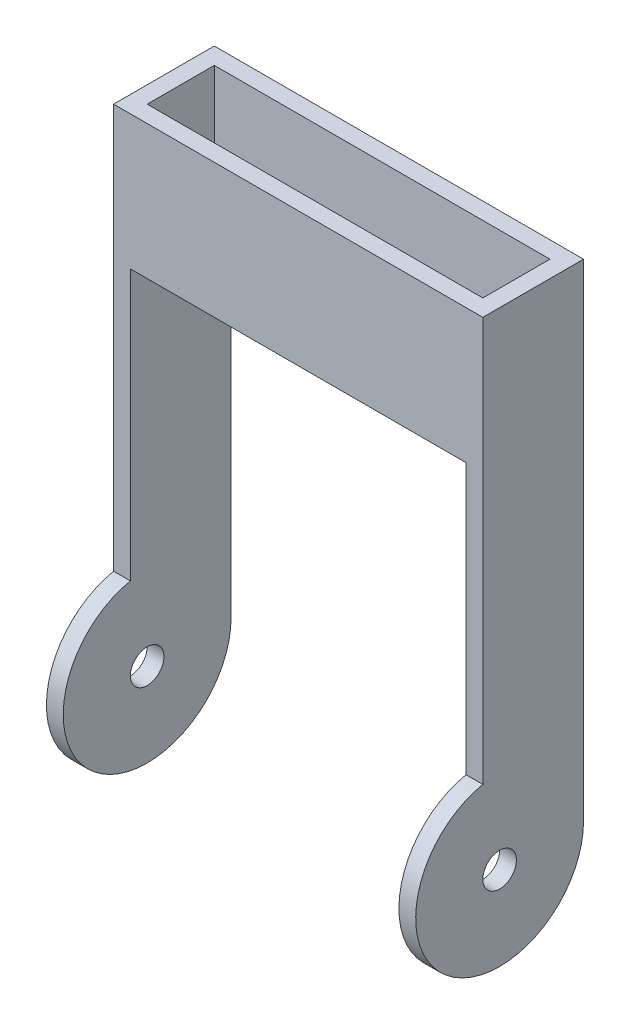
ISO-10303-21;
HEADER;
FILE_DESCRIPTION(('STEP AP214'),'2;1');
FILE_NAME('part.step','',(''),(''),'','','');
FILE_SCHEMA(('AUTOMOTIVE_DESIGN { 1 0 10303 214 1 1 1 1 }'));
ENDSEC;
DATA;
#1=APPLICATION_CONTEXT('core data for automotive mechanical design processes');
#2=APPLICATION_PROTOCOL_DEFINITION('international standard','automotive_design',2000,#1);
#3=PRODUCT_CONTEXT('',#1,'mechanical');
#4=PRODUCT('Part','Part','',(#3));
#5=PRODUCT_RELATED_PRODUCT_CATEGORY('part','',(#4));
#6=PRODUCT_DEFINITION_FORMATION('','',#4);
#7=PRODUCT_DEFINITION_CONTEXT('part definition',#1,'design');
#8=PRODUCT_DEFINITION('design','',#6,#7);
#9=PRODUCT_DEFINITION_SHAPE('','',#8);
#10=(LENGTH_UNIT() NAMED_UNIT(*) SI_UNIT(.MILLI.,.METRE.));
#11=(NAMED_UNIT(*) PLANE_ANGLE_UNIT() SI_UNIT($,.RADIAN.));
#12=(NAMED_UNIT(*) SI_UNIT($,.STERADIAN.) SOLID_ANGLE_UNIT());
#13=UNCERTAINTY_MEASURE_WITH_UNIT(LENGTH_MEASURE(1.E-05),#10,'distance_accuracy_value','');
#14=(GEOMETRIC_REPRESENTATION_CONTEXT(3) GLOBAL_UNCERTAINTY_ASSIGNED_CONTEXT((#13)) GLOBAL_UNIT_ASSIGNED_CONTEXT((#10,
#11,#12)) REPRESENTATION_CONTEXT('',''));
#15=CARTESIAN_POINT('',(0.,0.,0.));
#16=DIRECTION('',(0.,0.,1.));
#17=DIRECTION('',(1.,0.,0.));
#18=AXIS2_PLACEMENT_3D('',#15,#16,#17);
#19=CARTESIAN_POINT('',(0.,0.,0.));
#20=DIRECTION('',(0.,1.,0.));
#21=DIRECTION('',(0.,0.,1.));
#22=AXIS2_PLACEMENT_3D('',#19,#20,#21);
#23=PLANE('',#22);
#24=DIRECTION('',(0.,0.,1.));
#25=VECTOR('',#24,1.);
#26=CARTESIAN_POINT('',(-31.75,0.,-9.525));
#27=LINE('',#26,#25);
#28=CARTESIAN_POINT('',(-31.75,0.,-9.525));
#29=VERTEX_POINT('',#28);
#30=CARTESIAN_POINT('',(-31.75,0.,-6.35));
#31=VERTEX_POINT('',#30);
#32=EDGE_CURVE('E76',#29,#31,#27,.T.);
#33=ORIENTED_EDGE('',*,*,#32,.F.);
#34=DIRECTION('',(-1.,0.,0.));
#35=VECTOR('',#34,1.);
#36=CARTESIAN_POINT('',(0.,0.,-9.525));
#37=LINE('',#36,#35);
#38=CARTESIAN_POINT('',(31.75,0.,-9.525));
#39=VERTEX_POINT('',#38);
#40=EDGE_CURVE('E228',#39,#29,#37,.T.);
#41=ORIENTED_EDGE('',*,*,#40,.F.);
#42=DIRECTION('',(0.,0.,-1.));
#43=VECTOR('',#42,1.);
#44=CARTESIAN_POINT('',(31.75,0.,-9.525));
#45=LINE('',#44,#43);
#46=CARTESIAN_POINT('',(31.75,0.,-6.35));
#47=VERTEX_POINT('',#46);
#48=EDGE_CURVE('E12',#47,#39,#45,.T.);
#49=ORIENTED_EDGE('',*,*,#48,.F.);
#50=DIRECTION('',(-1.,0.,0.));
#51=VECTOR('',#50,1.);
#52=CARTESIAN_POINT('',(-31.75,0.,-6.35));
#53=LINE('',#52,#51);
#54=EDGE_CURVE('E198',#47,#31,#53,.T.);
#55=ORIENTED_EDGE('',*,*,#54,.T.);
#56=EDGE_LOOP('',(#33,#41,#49,#55));
#57=FACE_BOUND('',#56,.T.);
#58=ADVANCED_FACE('F58',(#57),#23,.F.);
#59=CARTESIAN_POINT('',(-31.75,0.,6.35));
#60=VERTEX_POINT('',#59);
#61=CARTESIAN_POINT('',(-31.75,0.,9.525));
#62=VERTEX_POINT('',#61);
#63=EDGE_CURVE('E172',#60,#62,#27,.T.);
#64=ORIENTED_EDGE('',*,*,#63,.F.);
#65=DIRECTION('',(1.,0.,0.));
#66=VECTOR('',#65,1.);
#67=CARTESIAN_POINT('',(-31.75,0.,6.35));
#68=LINE('',#67,#66);
#69=CARTESIAN_POINT('',(31.75,0.,6.35));
#70=VERTEX_POINT('',#69);
#71=EDGE_CURVE('E209',#60,#70,#68,.T.);
#72=ORIENTED_EDGE('',*,*,#71,.T.);
#73=CARTESIAN_POINT('',(31.75,0.,9.525));
#74=VERTEX_POINT('',#73);
#75=EDGE_CURVE('E69',#74,#70,#45,.T.);
#76=ORIENTED_EDGE('',*,*,#75,.F.);
#77=DIRECTION('',(1.,0.,0.));
#78=VECTOR('',#77,1.);
#79=CARTESIAN_POINT('',(0.,0.,9.525));
#80=LINE('',#79,#78);
#81=EDGE_CURVE('E84',#62,#74,#80,.T.);
#82=ORIENTED_EDGE('',*,*,#81,.F.);
#83=EDGE_LOOP('',(#64,#72,#76,#82));
#84=FACE_BOUND('',#83,.T.);
#85=ADVANCED_FACE('F272',(#84),#23,.F.);
#86=CARTESIAN_POINT('',(0.,25.4,0.));
#87=DIRECTION('',(0.,1.,0.));
#88=DIRECTION('',(0.,0.,1.));
#89=AXIS2_PLACEMENT_3D('',#86,#87,#88);
#90=PLANE('',#89);
#91=DIRECTION('',(0.,0.,-1.));
#92=VECTOR('',#91,1.);
#93=CARTESIAN_POINT('',(34.925,25.4,0.));
#94=LINE('',#93,#92);
#95=CARTESIAN_POINT('',(34.925,25.4,9.525));
#96=VERTEX_POINT('',#95);
#97=CARTESIAN_POINT('',(34.925,25.4,-9.525));
#98=VERTEX_POINT('',#97);
#99=EDGE_CURVE('E229',#96,#98,#94,.T.);
#100=ORIENTED_EDGE('',*,*,#99,.T.);
#101=DIRECTION('',(-1.,0.,0.));
#102=VECTOR('',#101,1.);
#103=CARTESIAN_POINT('',(0.,25.4,-9.525));
#104=LINE('',#103,#102);
#105=CARTESIAN_POINT('',(-34.925,25.4,-9.525));
#106=VERTEX_POINT('',#105);
#107=EDGE_CURVE('E232',#98,#106,#104,.T.);
#108=ORIENTED_EDGE('',*,*,#107,.T.);
#109=DIRECTION('',(0.,0.,1.));
#110=VECTOR('',#109,1.);
#111=CARTESIAN_POINT('',(-34.925,25.4,0.));
#112=LINE('',#111,#110);
#113=CARTESIAN_POINT('',(-34.925,25.4,9.525));
#114=VERTEX_POINT('',#113);
#115=EDGE_CURVE('E234',#106,#114,#112,.T.);
#116=ORIENTED_EDGE('',*,*,#115,.T.);
#117=DIRECTION('',(1.,0.,0.));
#118=VECTOR('',#117,1.);
#119=CARTESIAN_POINT('',(0.,25.4,9.525));
#120=LINE('',#119,#118);
#121=EDGE_CURVE('E236',#114,#96,#120,.T.);
#122=ORIENTED_EDGE('',*,*,#121,.T.);
#123=EDGE_LOOP('',(#100,#108,#116,#122));
#124=FACE_BOUND('',#123,.T.);
#125=DIRECTION('',(-1.,0.,0.));
#126=VECTOR('',#125,1.);
#127=CARTESIAN_POINT('',(-31.75,25.4,-6.35));
#128=LINE('',#127,#126);
#129=CARTESIAN_POINT('',(31.75,25.4,-6.35));
#130=VERTEX_POINT('',#129);
#131=CARTESIAN_POINT('',(-31.75,25.4,-6.35));
#132=VERTEX_POINT('',#131);
#133=EDGE_CURVE('E208',#130,#132,#128,.T.);
#134=ORIENTED_EDGE('',*,*,#133,.F.);
#135=DIRECTION('',(0.,0.,-1.));
#136=VECTOR('',#135,1.);
#137=CARTESIAN_POINT('',(31.75,25.4,6.35));
#138=LINE('',#137,#136);
#139=CARTESIAN_POINT('',(31.75,25.4,6.35));
#140=VERTEX_POINT('',#139);
#141=EDGE_CURVE('E206',#140,#130,#138,.T.);
#142=ORIENTED_EDGE('',*,*,#141,.F.);
#143=DIRECTION('',(1.,0.,0.));
#144=VECTOR('',#143,1.);
#145=CARTESIAN_POINT('',(-31.75,25.4,6.35));
#146=LINE('',#145,#144);
#147=CARTESIAN_POINT('',(-31.75,25.4,6.35));
#148=VERTEX_POINT('',#147);
#149=EDGE_CURVE('E214',#148,#140,#146,.T.);
#150=ORIENTED_EDGE('',*,*,#149,.F.);
#151=DIRECTION('',(0.,0.,1.));
#152=VECTOR('',#151,1.);
#153=CARTESIAN_POINT('',(-31.75,25.4,6.35));
#154=LINE('',#153,#152);
#155=EDGE_CURVE('E211',#132,#148,#154,.T.);
#156=ORIENTED_EDGE('',*,*,#155,.F.);
#157=EDGE_LOOP('',(#134,#142,#150,#156));
#158=FACE_BOUND('',#157,.T.);
#159=ADVANCED_FACE('F266',(#124,#158),#90,.T.);
#160=CARTESIAN_POINT('',(34.925,25.4,0.));
#161=DIRECTION('',(-1.,0.,0.));
#162=DIRECTION('',(0.,0.,1.));
#163=AXIS2_PLACEMENT_3D('',#160,#161,#162);
#164=PLANE('',#163);
#165=CARTESIAN_POINT('',(34.925,-66.675,6.35));
#166=DIRECTION('',(-1.,0.,0.));
#167=DIRECTION('',(0.,0.,1.));
#168=AXIS2_PLACEMENT_3D('',#165,#166,#167);
#169=CIRCLE('',#168,3.175);
#170=CARTESIAN_POINT('',(34.925,-66.675,9.525));
#171=VERTEX_POINT('',#170);
#172=EDGE_CURVE('E297',#171,#171,#169,.F.);
#173=ORIENTED_EDGE('',*,*,#172,.F.);
#174=EDGE_LOOP('',(#173));
#175=FACE_BOUND('',#174,.T.);
#176=DIRECTION('',(0.,-1.,0.));
#177=VECTOR('',#176,1.);
#178=CARTESIAN_POINT('',(34.925,25.4,9.525));
#179=LINE('',#178,#177);
#180=CARTESIAN_POINT('',(34.925,-51.1207401333268,9.525));
#181=VERTEX_POINT('',#180);
#182=EDGE_CURVE('E238',#96,#181,#179,.T.);
#183=ORIENTED_EDGE('',*,*,#182,.T.);
#184=CARTESIAN_POINT('',(34.925,-66.675,6.35));
#185=DIRECTION('',(1.,0.,0.));
#186=DIRECTION('',(0.,0.,-1.));
#187=AXIS2_PLACEMENT_3D('',#184,#185,#186);
#188=CIRCLE('',#187,15.875);
#189=CARTESIAN_POINT('',(34.925,-66.675,-9.525));
#190=VERTEX_POINT('',#189);
#191=EDGE_CURVE('E189',#181,#190,#188,.T.);
#192=ORIENTED_EDGE('',*,*,#191,.T.);
#193=DIRECTION('',(0.,-1.,0.));
#194=VECTOR('',#193,1.);
#195=CARTESIAN_POINT('',(34.925,25.4,-9.525));
#196=LINE('',#195,#194);
#197=EDGE_CURVE('E67',#98,#190,#196,.T.);
#198=ORIENTED_EDGE('',*,*,#197,.F.);
#199=ORIENTED_EDGE('',*,*,#99,.F.);
#200=EDGE_LOOP('',(#183,#192,#198,#199));
#201=FACE_BOUND('',#200,.T.);
#202=ADVANCED_FACE('F60',(#175,#201),#164,.F.);
#203=CARTESIAN_POINT('',(0.,25.4,-9.525));
#204=DIRECTION('',(0.,0.,1.));
#205=DIRECTION('',(1.,0.,0.));
#206=AXIS2_PLACEMENT_3D('',#203,#204,#205);
#207=PLANE('',#206);
#208=ORIENTED_EDGE('',*,*,#197,.T.);
#209=DIRECTION('',(-1.,0.,0.));
#210=VECTOR('',#209,1.);
#211=CARTESIAN_POINT('',(34.925,-66.675,-9.525));
#212=LINE('',#211,#210);
#213=CARTESIAN_POINT('',(31.75,-66.675,-9.525));
#214=VERTEX_POINT('',#213);
#215=EDGE_CURVE('E199',#214,#190,#212,.F.);
#216=ORIENTED_EDGE('',*,*,#215,.F.);
#217=DIRECTION('',(0.,1.,0.));
#218=VECTOR('',#217,1.);
#219=CARTESIAN_POINT('',(31.75,-82.551,-9.525));
#220=LINE('',#219,#218);
#221=EDGE_CURVE('E194',#214,#39,#220,.T.);
#222=ORIENTED_EDGE('',*,*,#221,.T.);
#223=ORIENTED_EDGE('',*,*,#40,.T.);
#224=DIRECTION('',(0.,1.,0.));
#225=VECTOR('',#224,1.);
#226=CARTESIAN_POINT('',(-31.75,-82.551,-9.525));
#227=LINE('',#226,#225);
#228=CARTESIAN_POINT('',(-31.75,-66.675,-9.525));
#229=VERTEX_POINT('',#228);
#230=EDGE_CURVE('E164',#229,#29,#227,.T.);
#231=ORIENTED_EDGE('',*,*,#230,.F.);
#232=DIRECTION('',(-1.,0.,0.));
#233=VECTOR('',#232,1.);
#234=CARTESIAN_POINT('',(34.925,-66.675,-9.525));
#235=LINE('',#234,#233);
#236=CARTESIAN_POINT('',(-34.925,-66.675,-9.525));
#237=VERTEX_POINT('',#236);
#238=EDGE_CURVE('E163',#237,#229,#235,.F.);
#239=ORIENTED_EDGE('',*,*,#238,.F.);
#240=DIRECTION('',(0.,-1.,0.));
#241=VECTOR('',#240,1.);
#242=CARTESIAN_POINT('',(-34.925,25.4,-9.525));
#243=LINE('',#242,#241);
#244=EDGE_CURVE('E243',#106,#237,#243,.T.);
#245=ORIENTED_EDGE('',*,*,#244,.F.);
#246=ORIENTED_EDGE('',*,*,#107,.F.);
#247=EDGE_LOOP('',(#208,#216,#222,#223,#231,#239,#245,#246));
#248=FACE_BOUND('',#247,.T.);
#249=ADVANCED_FACE('F246',(#248),#207,.F.);
#250=CARTESIAN_POINT('',(-34.925,25.4,0.));
#251=DIRECTION('',(1.,0.,0.));
#252=DIRECTION('',(0.,0.,-1.));
#253=AXIS2_PLACEMENT_3D('',#250,#251,#252);
#254=PLANE('',#253);
#255=CARTESIAN_POINT('',(-34.925,-66.675,6.35));
#256=DIRECTION('',(-1.,0.,0.));
#257=DIRECTION('',(0.,0.,1.));
#258=AXIS2_PLACEMENT_3D('',#255,#256,#257);
#259=CIRCLE('',#258,3.175);
#260=CARTESIAN_POINT('',(-34.925,-66.675,9.525));
#261=VERTEX_POINT('',#260);
#262=EDGE_CURVE('E299',#261,#261,#259,.T.);
#263=ORIENTED_EDGE('',*,*,#262,.F.);
#264=EDGE_LOOP('',(#263));
#265=FACE_BOUND('',#264,.T.);
#266=ORIENTED_EDGE('',*,*,#244,.T.);
#267=CARTESIAN_POINT('',(-34.925,-66.675,6.35));
#268=DIRECTION('',(1.,0.,0.));
#269=DIRECTION('',(0.,0.,-1.));
#270=AXIS2_PLACEMENT_3D('',#267,#268,#269);
#271=CIRCLE('',#270,15.875);
#272=CARTESIAN_POINT('',(-34.925,-51.1207401333268,9.525));
#273=VERTEX_POINT('',#272);
#274=EDGE_CURVE('E177',#273,#237,#271,.T.);
#275=ORIENTED_EDGE('',*,*,#274,.F.);
#276=DIRECTION('',(0.,-1.,0.));
#277=VECTOR('',#276,1.);
#278=CARTESIAN_POINT('',(-34.925,25.4,9.525));
#279=LINE('',#278,#277);
#280=EDGE_CURVE('E158',#114,#273,#279,.T.);
#281=ORIENTED_EDGE('',*,*,#280,.F.);
#282=ORIENTED_EDGE('',*,*,#115,.F.);
#283=EDGE_LOOP('',(#266,#275,#281,#282));
#284=FACE_BOUND('',#283,.T.);
#285=ADVANCED_FACE('F285',(#265,#284),#254,.F.);
#286=CARTESIAN_POINT('',(0.,25.4,9.525));
#287=DIRECTION('',(0.,0.,-1.));
#288=DIRECTION('',(-1.,0.,0.));
#289=AXIS2_PLACEMENT_3D('',#286,#287,#288);
#290=PLANE('',#289);
#291=ORIENTED_EDGE('',*,*,#280,.T.);
#292=DIRECTION('',(-1.,0.,0.));
#293=VECTOR('',#292,1.);
#294=CARTESIAN_POINT('',(34.925,-51.1207401333268,9.525));
#295=LINE('',#294,#293);
#296=CARTESIAN_POINT('',(-31.75,-51.1207401333268,9.525));
#297=VERTEX_POINT('',#296);
#298=EDGE_CURVE('E152',#297,#273,#295,.T.);
#299=ORIENTED_EDGE('',*,*,#298,.F.);
#300=DIRECTION('',(0.,1.,0.));
#301=VECTOR('',#300,1.);
#302=CARTESIAN_POINT('',(-31.75,-82.551,9.525));
#303=LINE('',#302,#301);
#304=EDGE_CURVE('E155',#297,#62,#303,.T.);
#305=ORIENTED_EDGE('',*,*,#304,.T.);
#306=ORIENTED_EDGE('',*,*,#81,.T.);
#307=DIRECTION('',(0.,1.,0.));
#308=VECTOR('',#307,1.);
#309=CARTESIAN_POINT('',(31.75,-82.551,9.525));
#310=LINE('',#309,#308);
#311=CARTESIAN_POINT('',(31.75,-51.1207401333268,9.525));
#312=VERTEX_POINT('',#311);
#313=EDGE_CURVE('E191',#312,#74,#310,.T.);
#314=ORIENTED_EDGE('',*,*,#313,.F.);
#315=DIRECTION('',(-1.,0.,0.));
#316=VECTOR('',#315,1.);
#317=CARTESIAN_POINT('',(34.925,-51.1207401333268,9.525));
#318=LINE('',#317,#316);
#319=EDGE_CURVE('E195',#181,#312,#318,.T.);
#320=ORIENTED_EDGE('',*,*,#319,.F.);
#321=ORIENTED_EDGE('',*,*,#182,.F.);
#322=ORIENTED_EDGE('',*,*,#121,.F.);
#323=EDGE_LOOP('',(#291,#299,#305,#306,#314,#320,#321,#322));
#324=FACE_BOUND('',#323,.T.);
#325=ADVANCED_FACE('F154',(#324),#290,.F.);
#326=CARTESIAN_POINT('',(31.75,25.4,6.35));
#327=DIRECTION('',(-1.,0.,0.));
#328=DIRECTION('',(0.,0.,1.));
#329=AXIS2_PLACEMENT_3D('',#326,#327,#328);
#330=PLANE('',#329);
#331=CARTESIAN_POINT('',(31.75,-66.675,6.35));
#332=DIRECTION('',(-1.,0.,0.));
#333=DIRECTION('',(0.,0.,1.));
#334=AXIS2_PLACEMENT_3D('',#331,#332,#333);
#335=CIRCLE('',#334,3.175);
#336=CARTESIAN_POINT('',(31.75,-66.675,9.525));
#337=VERTEX_POINT('',#336);
#338=EDGE_CURVE('E180',#337,#337,#335,.T.);
#339=ORIENTED_EDGE('',*,*,#338,.F.);
#340=EDGE_LOOP('',(#339));
#341=FACE_BOUND('',#340,.T.);
#342=DIRECTION('',(0.,-1.,0.));
#343=VECTOR('',#342,1.);
#344=CARTESIAN_POINT('',(31.75,25.4,-6.35));
#345=LINE('',#344,#343);
#346=EDGE_CURVE('E225',#130,#47,#345,.T.);
#347=ORIENTED_EDGE('',*,*,#346,.T.);
#348=ORIENTED_EDGE('',*,*,#48,.T.);
#349=ORIENTED_EDGE('',*,*,#221,.F.);
#350=CARTESIAN_POINT('',(31.75,-66.675,6.35));
#351=DIRECTION('',(1.,0.,0.));
#352=DIRECTION('',(0.,0.,-1.));
#353=AXIS2_PLACEMENT_3D('',#350,#351,#352);
#354=CIRCLE('',#353,15.875);
#355=EDGE_CURVE('E184',#312,#214,#354,.T.);
#356=ORIENTED_EDGE('',*,*,#355,.F.);
#357=ORIENTED_EDGE('',*,*,#313,.T.);
#358=ORIENTED_EDGE('',*,*,#75,.T.);
#359=DIRECTION('',(0.,-1.,0.));
#360=VECTOR('',#359,1.);
#361=CARTESIAN_POINT('',(31.75,25.4,6.35));
#362=LINE('',#361,#360);
#363=EDGE_CURVE('E216',#140,#70,#362,.T.);
#364=ORIENTED_EDGE('',*,*,#363,.F.);
#365=ORIENTED_EDGE('',*,*,#141,.T.);
#366=EDGE_LOOP('',(#347,#348,#349,#356,#357,#358,#364,#365));
#367=FACE_BOUND('',#366,.T.);
#368=ADVANCED_FACE('F258',(#341,#367),#330,.T.);
#369=CARTESIAN_POINT('',(-31.75,25.4,-6.35));
#370=DIRECTION('',(0.,0.,1.));
#371=DIRECTION('',(1.,0.,0.));
#372=AXIS2_PLACEMENT_3D('',#369,#370,#371);
#373=PLANE('',#372);
#374=ORIENTED_EDGE('',*,*,#54,.F.);
#375=ORIENTED_EDGE('',*,*,#346,.F.);
#376=ORIENTED_EDGE('',*,*,#133,.T.);
#377=DIRECTION('',(0.,-1.,0.));
#378=VECTOR('',#377,1.);
#379=CARTESIAN_POINT('',(-31.75,25.4,-6.35));
#380=LINE('',#379,#378);
#381=EDGE_CURVE('E223',#132,#31,#380,.T.);
#382=ORIENTED_EDGE('',*,*,#381,.T.);
#383=EDGE_LOOP('',(#374,#375,#376,#382));
#384=FACE_BOUND('',#383,.T.);
#385=ADVANCED_FACE('F310',(#384),#373,.T.);
#386=CARTESIAN_POINT('',(-31.75,25.4,6.35));
#387=DIRECTION('',(1.,0.,0.));
#388=DIRECTION('',(0.,0.,-1.));
#389=AXIS2_PLACEMENT_3D('',#386,#387,#388);
#390=PLANE('',#389);
#391=CARTESIAN_POINT('',(-31.75,-66.675,6.35));
#392=DIRECTION('',(1.,0.,0.));
#393=DIRECTION('',(0.,0.,-1.));
#394=AXIS2_PLACEMENT_3D('',#391,#392,#393);
#395=CIRCLE('',#394,3.175);
#396=CARTESIAN_POINT('',(-31.75,-66.675,3.175));
#397=VERTEX_POINT('',#396);
#398=EDGE_CURVE('E62',#397,#397,#395,.T.);
#399=ORIENTED_EDGE('',*,*,#398,.F.);
#400=EDGE_LOOP('',(#399));
#401=FACE_BOUND('',#400,.T.);
#402=DIRECTION('',(0.,-1.,0.));
#403=VECTOR('',#402,1.);
#404=CARTESIAN_POINT('',(-31.75,25.4,6.35));
#405=LINE('',#404,#403);
#406=EDGE_CURVE('E221',#148,#60,#405,.T.);
#407=ORIENTED_EDGE('',*,*,#406,.T.);
#408=ORIENTED_EDGE('',*,*,#63,.T.);
#409=ORIENTED_EDGE('',*,*,#304,.F.);
#410=CARTESIAN_POINT('',(-31.75,-66.675,6.35));
#411=DIRECTION('',(1.,0.,0.));
#412=DIRECTION('',(0.,0.,-1.));
#413=AXIS2_PLACEMENT_3D('',#410,#411,#412);
#414=CIRCLE('',#413,15.875);
#415=EDGE_CURVE('E171',#297,#229,#414,.T.);
#416=ORIENTED_EDGE('',*,*,#415,.T.);
#417=ORIENTED_EDGE('',*,*,#230,.T.);
#418=ORIENTED_EDGE('',*,*,#32,.T.);
#419=ORIENTED_EDGE('',*,*,#381,.F.);
#420=ORIENTED_EDGE('',*,*,#155,.T.);
#421=EDGE_LOOP('',(#407,#408,#409,#416,#417,#418,#419,#420));
#422=FACE_BOUND('',#421,.T.);
#423=ADVANCED_FACE('F169',(#401,#422),#390,.T.);
#424=CARTESIAN_POINT('',(-31.75,25.4,6.35));
#425=DIRECTION('',(0.,0.,-1.));
#426=DIRECTION('',(-1.,0.,0.));
#427=AXIS2_PLACEMENT_3D('',#424,#425,#426);
#428=PLANE('',#427);
#429=ORIENTED_EDGE('',*,*,#71,.F.);
#430=ORIENTED_EDGE('',*,*,#406,.F.);
#431=ORIENTED_EDGE('',*,*,#149,.T.);
#432=ORIENTED_EDGE('',*,*,#363,.T.);
#433=EDGE_LOOP('',(#429,#430,#431,#432));
#434=FACE_BOUND('',#433,.T.);
#435=ADVANCED_FACE('F270',(#434),#428,.T.);
#436=CARTESIAN_POINT('',(34.925,-66.675,6.35));
#437=DIRECTION('',(-1.,0.,0.));
#438=DIRECTION('',(0.,0.,1.));
#439=AXIS2_PLACEMENT_3D('',#436,#437,#438);
#440=CYLINDRICAL_SURFACE('',#439,15.875);
#441=ORIENTED_EDGE('',*,*,#355,.T.);
#442=ORIENTED_EDGE('',*,*,#215,.T.);
#443=ORIENTED_EDGE('',*,*,#191,.F.);
#444=ORIENTED_EDGE('',*,*,#319,.T.);
#445=EDGE_LOOP('',(#441,#442,#443,#444));
#446=FACE_BOUND('',#445,.T.);
#447=ADVANCED_FACE('F253',(#446),#440,.T.);
#448=CARTESIAN_POINT('',(34.925,-66.675,6.35));
#449=DIRECTION('',(-1.,0.,0.));
#450=DIRECTION('',(0.,0.,1.));
#451=AXIS2_PLACEMENT_3D('',#448,#449,#450);
#452=CYLINDRICAL_SURFACE('',#451,15.875);
#453=ORIENTED_EDGE('',*,*,#274,.T.);
#454=ORIENTED_EDGE('',*,*,#238,.T.);
#455=ORIENTED_EDGE('',*,*,#415,.F.);
#456=ORIENTED_EDGE('',*,*,#298,.T.);
#457=EDGE_LOOP('',(#453,#454,#455,#456));
#458=FACE_BOUND('',#457,.T.);
#459=ADVANCED_FACE('F175',(#458),#452,.T.);
#460=CARTESIAN_POINT('',(43.9052561210692,-66.675,6.35));
#461=DIRECTION('',(-1.,0.,0.));
#462=DIRECTION('',(0.,0.,1.));
#463=AXIS2_PLACEMENT_3D('',#460,#461,#462);
#464=CYLINDRICAL_SURFACE('',#463,3.175);
#465=ORIENTED_EDGE('',*,*,#398,.T.);
#466=EDGE_LOOP('',(#465));
#467=FACE_BOUND('',#466,.T.);
#468=ORIENTED_EDGE('',*,*,#262,.T.);
#469=EDGE_LOOP('',(#468));
#470=FACE_BOUND('',#469,.T.);
#471=ADVANCED_FACE('F325',(#467,#470),#464,.F.);
#472=ORIENTED_EDGE('',*,*,#338,.T.);
#473=EDGE_LOOP('',(#472));
#474=FACE_BOUND('',#473,.T.);
#475=ORIENTED_EDGE('',*,*,#172,.T.);
#476=EDGE_LOOP('',(#475));
#477=FACE_BOUND('',#476,.T.);
#478=ADVANCED_FACE('F307',(#474,#477),#464,.F.);
#479=CLOSED_SHELL('',(#58,#85,#159,#202,#249,#285,#325,#368,#385,#423,#435,#447,#459,#471,#478));
#480=MANIFOLD_SOLID_BREP('B2',#479);
#481=ADVANCED_BREP_SHAPE_REPRESENTATION('',(#18,#480),#14);
#482=SHAPE_DEFINITION_REPRESENTATION(#9,#481);
ENDSEC;
END-ISO-10303-21;
